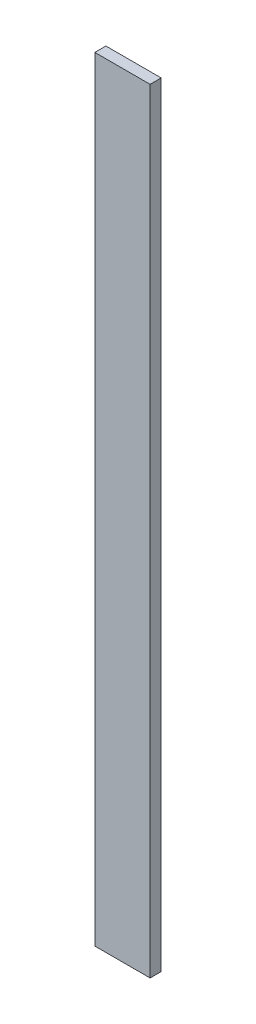
ISO-10303-21;
HEADER;
FILE_DESCRIPTION(('STEP AP214'),'2;1');
FILE_NAME('part.step','',(''),(''),'','','');
FILE_SCHEMA(('AUTOMOTIVE_DESIGN { 1 0 10303 214 1 1 1 1 }'));
ENDSEC;
DATA;
#1=APPLICATION_CONTEXT('core data for automotive mechanical design processes');
#2=APPLICATION_PROTOCOL_DEFINITION('international standard','automotive_design',2000,#1);
#3=PRODUCT_CONTEXT('',#1,'mechanical');
#4=PRODUCT('Part','Part','',(#3));
#5=PRODUCT_RELATED_PRODUCT_CATEGORY('part','',(#4));
#6=PRODUCT_DEFINITION_FORMATION('','',#4);
#7=PRODUCT_DEFINITION_CONTEXT('part definition',#1,'design');
#8=PRODUCT_DEFINITION('design','',#6,#7);
#9=PRODUCT_DEFINITION_SHAPE('','',#8);
#10=(LENGTH_UNIT() NAMED_UNIT(*) SI_UNIT(.MILLI.,.METRE.));
#11=(NAMED_UNIT(*) PLANE_ANGLE_UNIT() SI_UNIT($,.RADIAN.));
#12=(NAMED_UNIT(*) SI_UNIT($,.STERADIAN.) SOLID_ANGLE_UNIT());
#13=UNCERTAINTY_MEASURE_WITH_UNIT(LENGTH_MEASURE(1.E-05),#10,'distance_accuracy_value','');
#14=(GEOMETRIC_REPRESENTATION_CONTEXT(3) GLOBAL_UNCERTAINTY_ASSIGNED_CONTEXT((#13)) GLOBAL_UNIT_ASSIGNED_CONTEXT((#10,
#11,#12)) REPRESENTATION_CONTEXT('',''));
#15=CARTESIAN_POINT('',(0.,0.,0.));
#16=DIRECTION('',(0.,0.,1.));
#17=DIRECTION('',(1.,0.,0.));
#18=AXIS2_PLACEMENT_3D('',#15,#16,#17);
#19=CARTESIAN_POINT('',(36.3259123941795,175.,0.));
#20=DIRECTION('',(1.,0.,0.));
#21=DIRECTION('',(0.,0.,-1.));
#22=AXIS2_PLACEMENT_3D('',#19,#20,#21);
#23=PLANE('',#22);
#24=DIRECTION('',(0.,0.,1.));
#25=VECTOR('',#24,1.);
#26=CARTESIAN_POINT('',(36.3259123941795,-175.,0.));
#27=LINE('',#26,#25);
#28=CARTESIAN_POINT('',(36.3259123941795,-175.,0.));
#29=VERTEX_POINT('',#28);
#30=CARTESIAN_POINT('',(36.3259123941795,-175.,4.99999999999994));
#31=VERTEX_POINT('',#30);
#32=EDGE_CURVE('E109',#29,#31,#27,.T.);
#33=ORIENTED_EDGE('',*,*,#32,.T.);
#34=DIRECTION('',(0.,-1.,0.));
#35=VECTOR('',#34,1.);
#36=CARTESIAN_POINT('',(36.3259123941795,175.,4.99999999999994));
#37=LINE('',#36,#35);
#38=CARTESIAN_POINT('',(36.3259123941795,175.,4.99999999999994));
#39=VERTEX_POINT('',#38);
#40=EDGE_CURVE('E11',#39,#31,#37,.T.);
#41=ORIENTED_EDGE('',*,*,#40,.F.);
#42=DIRECTION('',(0.,0.,1.));
#43=VECTOR('',#42,1.);
#44=CARTESIAN_POINT('',(36.3259123941795,175.,0.));
#45=LINE('',#44,#43);
#46=CARTESIAN_POINT('',(36.3259123941795,175.,0.));
#47=VERTEX_POINT('',#46);
#48=EDGE_CURVE('E93',#47,#39,#45,.T.);
#49=ORIENTED_EDGE('',*,*,#48,.F.);
#50=DIRECTION('',(0.,-1.,0.));
#51=VECTOR('',#50,1.);
#52=CARTESIAN_POINT('',(36.3259123941795,175.,0.));
#53=LINE('',#52,#51);
#54=EDGE_CURVE('E105',#47,#29,#53,.T.);
#55=ORIENTED_EDGE('',*,*,#54,.T.);
#56=EDGE_LOOP('',(#33,#41,#49,#55));
#57=FACE_BOUND('',#56,.T.);
#58=ADVANCED_FACE('F41',(#57),#23,.F.);
#59=CARTESIAN_POINT('',(36.3259123941795,175.,4.99999999999994));
#60=DIRECTION('',(0.,0.,-1.));
#61=DIRECTION('',(-1.,0.,0.));
#62=AXIS2_PLACEMENT_3D('',#59,#60,#61);
#63=PLANE('',#62);
#64=DIRECTION('',(1.,0.,0.));
#65=VECTOR('',#64,1.);
#66=CARTESIAN_POINT('',(36.3259123941795,-175.,4.99999999999994));
#67=LINE('',#66,#65);
#68=CARTESIAN_POINT('',(61.3259123941795,-175.,4.99999999999994));
#69=VERTEX_POINT('',#68);
#70=EDGE_CURVE('E98',#31,#69,#67,.T.);
#71=ORIENTED_EDGE('',*,*,#70,.T.);
#72=DIRECTION('',(0.,-1.,0.));
#73=VECTOR('',#72,1.);
#74=CARTESIAN_POINT('',(61.3259123941795,175.,4.99999999999994));
#75=LINE('',#74,#73);
#76=CARTESIAN_POINT('',(61.3259123941795,175.,4.99999999999994));
#77=VERTEX_POINT('',#76);
#78=EDGE_CURVE('E50',#77,#69,#75,.T.);
#79=ORIENTED_EDGE('',*,*,#78,.F.);
#80=DIRECTION('',(1.,0.,0.));
#81=VECTOR('',#80,1.);
#82=CARTESIAN_POINT('',(36.3259123941795,175.,4.99999999999994));
#83=LINE('',#82,#81);
#84=EDGE_CURVE('E88',#39,#77,#83,.T.);
#85=ORIENTED_EDGE('',*,*,#84,.F.);
#86=ORIENTED_EDGE('',*,*,#40,.T.);
#87=EDGE_LOOP('',(#71,#79,#85,#86));
#88=FACE_BOUND('',#87,.T.);
#89=ADVANCED_FACE('F97',(#88),#63,.F.);
#90=CARTESIAN_POINT('',(61.3259123941795,175.,0.));
#91=DIRECTION('',(-1.,0.,0.));
#92=DIRECTION('',(0.,0.,1.));
#93=AXIS2_PLACEMENT_3D('',#90,#91,#92);
#94=PLANE('',#93);
#95=DIRECTION('',(0.,0.,-1.));
#96=VECTOR('',#95,1.);
#97=CARTESIAN_POINT('',(61.3259123941795,-175.,0.));
#98=LINE('',#97,#96);
#99=CARTESIAN_POINT('',(61.3259123941795,-175.,0.));
#100=VERTEX_POINT('',#99);
#101=EDGE_CURVE('E75',#69,#100,#98,.T.);
#102=ORIENTED_EDGE('',*,*,#101,.T.);
#103=DIRECTION('',(0.,-1.,0.));
#104=VECTOR('',#103,1.);
#105=CARTESIAN_POINT('',(61.3259123941795,175.,0.));
#106=LINE('',#105,#104);
#107=CARTESIAN_POINT('',(61.3259123941795,175.,0.));
#108=VERTEX_POINT('',#107);
#109=EDGE_CURVE('E100',#108,#100,#106,.T.);
#110=ORIENTED_EDGE('',*,*,#109,.F.);
#111=DIRECTION('',(0.,0.,-1.));
#112=VECTOR('',#111,1.);
#113=CARTESIAN_POINT('',(61.3259123941795,175.,0.));
#114=LINE('',#113,#112);
#115=EDGE_CURVE('E91',#77,#108,#114,.T.);
#116=ORIENTED_EDGE('',*,*,#115,.F.);
#117=ORIENTED_EDGE('',*,*,#78,.T.);
#118=EDGE_LOOP('',(#102,#110,#116,#117));
#119=FACE_BOUND('',#118,.T.);
#120=ADVANCED_FACE('F101',(#119),#94,.F.);
#121=CARTESIAN_POINT('',(36.3259123941795,175.,0.));
#122=DIRECTION('',(0.,0.,1.));
#123=DIRECTION('',(1.,0.,0.));
#124=AXIS2_PLACEMENT_3D('',#121,#122,#123);
#125=PLANE('',#124);
#126=DIRECTION('',(-1.,0.,0.));
#127=VECTOR('',#126,1.);
#128=CARTESIAN_POINT('',(36.3259123941795,-175.,0.));
#129=LINE('',#128,#127);
#130=EDGE_CURVE('E81',#100,#29,#129,.T.);
#131=ORIENTED_EDGE('',*,*,#130,.T.);
#132=ORIENTED_EDGE('',*,*,#54,.F.);
#133=DIRECTION('',(-1.,0.,0.));
#134=VECTOR('',#133,1.);
#135=CARTESIAN_POINT('',(36.3259123941795,175.,0.));
#136=LINE('',#135,#134);
#137=EDGE_CURVE('E58',#108,#47,#136,.T.);
#138=ORIENTED_EDGE('',*,*,#137,.F.);
#139=ORIENTED_EDGE('',*,*,#109,.T.);
#140=EDGE_LOOP('',(#131,#132,#138,#139));
#141=FACE_BOUND('',#140,.T.);
#142=ADVANCED_FACE('F122',(#141),#125,.F.);
#143=CARTESIAN_POINT('',(0.,175.,0.));
#144=DIRECTION('',(0.,1.,0.));
#145=DIRECTION('',(0.,0.,1.));
#146=AXIS2_PLACEMENT_3D('',#143,#144,#145);
#147=PLANE('',#146);
#148=ORIENTED_EDGE('',*,*,#48,.T.);
#149=ORIENTED_EDGE('',*,*,#84,.T.);
#150=ORIENTED_EDGE('',*,*,#115,.T.);
#151=ORIENTED_EDGE('',*,*,#137,.T.);
#152=EDGE_LOOP('',(#148,#149,#150,#151));
#153=FACE_BOUND('',#152,.T.);
#154=ADVANCED_FACE('F89',(#153),#147,.T.);
#155=CARTESIAN_POINT('',(0.,-175.,0.));
#156=DIRECTION('',(0.,1.,0.));
#157=DIRECTION('',(0.,0.,1.));
#158=AXIS2_PLACEMENT_3D('',#155,#156,#157);
#159=PLANE('',#158);
#160=ORIENTED_EDGE('',*,*,#32,.F.);
#161=ORIENTED_EDGE('',*,*,#130,.F.);
#162=ORIENTED_EDGE('',*,*,#101,.F.);
#163=ORIENTED_EDGE('',*,*,#70,.F.);
#164=EDGE_LOOP('',(#160,#161,#162,#163));
#165=FACE_BOUND('',#164,.T.);
#166=ADVANCED_FACE('F125',(#165),#159,.F.);
#167=CLOSED_SHELL('',(#58,#89,#120,#142,#154,#166));
#168=MANIFOLD_SOLID_BREP('B2',#167);
#169=ADVANCED_BREP_SHAPE_REPRESENTATION('',(#18,#168),#14);
#170=SHAPE_DEFINITION_REPRESENTATION(#9,#169);
ENDSEC;
END-ISO-10303-21;
